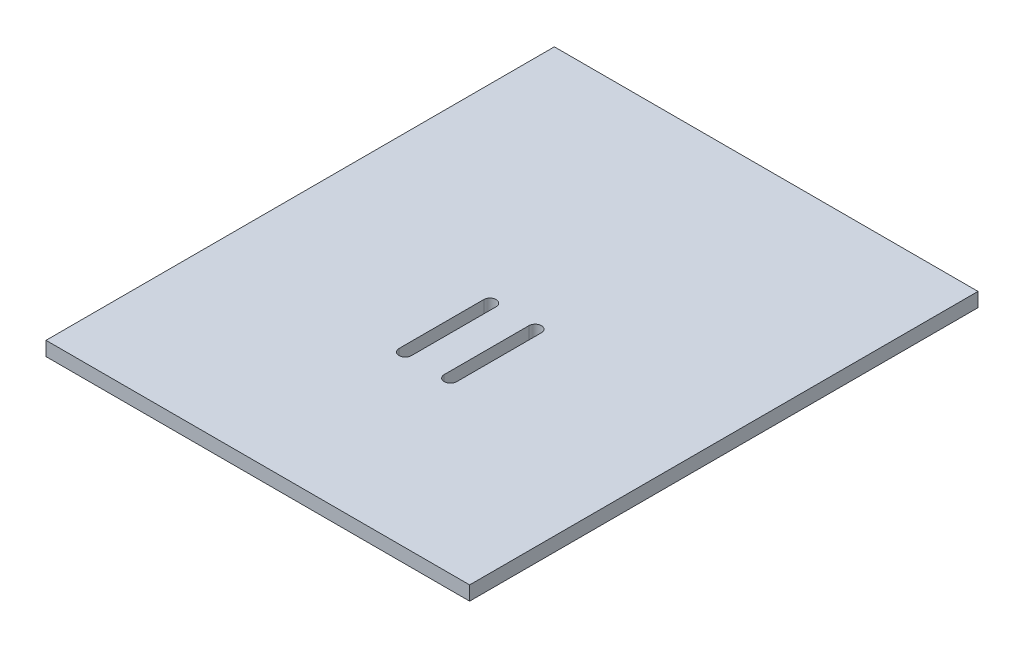
ISO-10303-21;
HEADER;
FILE_DESCRIPTION(('STEP AP214'),'2;1');
FILE_NAME('part.step','',(''),(''),'','','');
FILE_SCHEMA(('AUTOMOTIVE_DESIGN { 1 0 10303 214 1 1 1 1 }'));
ENDSEC;
DATA;
#1=APPLICATION_CONTEXT('core data for automotive mechanical design processes');
#2=APPLICATION_PROTOCOL_DEFINITION('international standard','automotive_design',2000,#1);
#3=PRODUCT_CONTEXT('',#1,'mechanical');
#4=PRODUCT('Part','Part','',(#3));
#5=PRODUCT_RELATED_PRODUCT_CATEGORY('part','',(#4));
#6=PRODUCT_DEFINITION_FORMATION('','',#4);
#7=PRODUCT_DEFINITION_CONTEXT('part definition',#1,'design');
#8=PRODUCT_DEFINITION('design','',#6,#7);
#9=PRODUCT_DEFINITION_SHAPE('','',#8);
#10=(LENGTH_UNIT() NAMED_UNIT(*) SI_UNIT(.MILLI.,.METRE.));
#11=(NAMED_UNIT(*) PLANE_ANGLE_UNIT() SI_UNIT($,.RADIAN.));
#12=(NAMED_UNIT(*) SI_UNIT($,.STERADIAN.) SOLID_ANGLE_UNIT());
#13=UNCERTAINTY_MEASURE_WITH_UNIT(LENGTH_MEASURE(1.E-05),#10,'distance_accuracy_value','');
#14=(GEOMETRIC_REPRESENTATION_CONTEXT(3) GLOBAL_UNCERTAINTY_ASSIGNED_CONTEXT((#13)) GLOBAL_UNIT_ASSIGNED_CONTEXT((#10,
#11,#12)) REPRESENTATION_CONTEXT('',''));
#15=CARTESIAN_POINT('',(0.,0.,0.));
#16=DIRECTION('',(0.,0.,1.));
#17=DIRECTION('',(1.,0.,0.));
#18=AXIS2_PLACEMENT_3D('',#15,#16,#17);
#19=CARTESIAN_POINT('',(95.25,6.35,-114.3));
#20=DIRECTION('',(-1.,0.,0.));
#21=DIRECTION('',(0.,0.,1.));
#22=AXIS2_PLACEMENT_3D('',#19,#20,#21);
#23=PLANE('',#22);
#24=DIRECTION('',(0.,0.,-1.));
#25=VECTOR('',#24,1.);
#26=CARTESIAN_POINT('',(95.25,0.,-114.3));
#27=LINE('',#26,#25);
#28=CARTESIAN_POINT('',(95.25,0.,114.3));
#29=VERTEX_POINT('',#28);
#30=CARTESIAN_POINT('',(95.25,0.,-114.3));
#31=VERTEX_POINT('',#30);
#32=EDGE_CURVE('E146',#29,#31,#27,.T.);
#33=ORIENTED_EDGE('',*,*,#32,.T.);
#34=DIRECTION('',(0.,-1.,0.));
#35=VECTOR('',#34,1.);
#36=CARTESIAN_POINT('',(95.25,6.35,-114.3));
#37=LINE('',#36,#35);
#38=CARTESIAN_POINT('',(95.25,6.35,-114.3));
#39=VERTEX_POINT('',#38);
#40=EDGE_CURVE('E11',#39,#31,#37,.T.);
#41=ORIENTED_EDGE('',*,*,#40,.F.);
#42=DIRECTION('',(0.,0.,-1.));
#43=VECTOR('',#42,1.);
#44=CARTESIAN_POINT('',(95.25,6.35,-114.3));
#45=LINE('',#44,#43);
#46=CARTESIAN_POINT('',(95.25,6.35,114.3));
#47=VERTEX_POINT('',#46);
#48=EDGE_CURVE('E220',#47,#39,#45,.T.);
#49=ORIENTED_EDGE('',*,*,#48,.F.);
#50=DIRECTION('',(0.,-1.,0.));
#51=VECTOR('',#50,1.);
#52=CARTESIAN_POINT('',(95.25,6.35,114.3));
#53=LINE('',#52,#51);
#54=EDGE_CURVE('E234',#47,#29,#53,.T.);
#55=ORIENTED_EDGE('',*,*,#54,.T.);
#56=EDGE_LOOP('',(#33,#41,#49,#55));
#57=FACE_BOUND('',#56,.T.);
#58=ADVANCED_FACE('F39',(#57),#23,.F.);
#59=CARTESIAN_POINT('',(-95.25,6.35,-114.3));
#60=DIRECTION('',(0.,0.,1.));
#61=DIRECTION('',(1.,0.,0.));
#62=AXIS2_PLACEMENT_3D('',#59,#60,#61);
#63=PLANE('',#62);
#64=DIRECTION('',(-1.,0.,0.));
#65=VECTOR('',#64,1.);
#66=CARTESIAN_POINT('',(-95.25,0.,-114.3));
#67=LINE('',#66,#65);
#68=CARTESIAN_POINT('',(-95.25,0.,-114.3));
#69=VERTEX_POINT('',#68);
#70=EDGE_CURVE('E238',#31,#69,#67,.T.);
#71=ORIENTED_EDGE('',*,*,#70,.T.);
#72=DIRECTION('',(0.,-1.,0.));
#73=VECTOR('',#72,1.);
#74=CARTESIAN_POINT('',(-95.25,6.35,-114.3));
#75=LINE('',#74,#73);
#76=CARTESIAN_POINT('',(-95.25,6.35,-114.3));
#77=VERTEX_POINT('',#76);
#78=EDGE_CURVE('E47',#77,#69,#75,.T.);
#79=ORIENTED_EDGE('',*,*,#78,.F.);
#80=DIRECTION('',(-1.,0.,0.));
#81=VECTOR('',#80,1.);
#82=CARTESIAN_POINT('',(-95.25,6.35,-114.3));
#83=LINE('',#82,#81);
#84=EDGE_CURVE('E224',#39,#77,#83,.T.);
#85=ORIENTED_EDGE('',*,*,#84,.F.);
#86=ORIENTED_EDGE('',*,*,#40,.T.);
#87=EDGE_LOOP('',(#71,#79,#85,#86));
#88=FACE_BOUND('',#87,.T.);
#89=ADVANCED_FACE('F273',(#88),#63,.F.);
#90=CARTESIAN_POINT('',(-95.25,6.35,-114.3));
#91=DIRECTION('',(1.,0.,0.));
#92=DIRECTION('',(0.,0.,-1.));
#93=AXIS2_PLACEMENT_3D('',#90,#91,#92);
#94=PLANE('',#93);
#95=DIRECTION('',(0.,0.,1.));
#96=VECTOR('',#95,1.);
#97=CARTESIAN_POINT('',(-95.25,0.,-114.3));
#98=LINE('',#97,#96);
#99=CARTESIAN_POINT('',(-95.25,0.,114.3));
#100=VERTEX_POINT('',#99);
#101=EDGE_CURVE('E241',#69,#100,#98,.T.);
#102=ORIENTED_EDGE('',*,*,#101,.T.);
#103=DIRECTION('',(0.,-1.,0.));
#104=VECTOR('',#103,1.);
#105=CARTESIAN_POINT('',(-95.25,6.35,114.3));
#106=LINE('',#105,#104);
#107=CARTESIAN_POINT('',(-95.25,6.35,114.3));
#108=VERTEX_POINT('',#107);
#109=EDGE_CURVE('E249',#108,#100,#106,.T.);
#110=ORIENTED_EDGE('',*,*,#109,.F.);
#111=DIRECTION('',(0.,0.,1.));
#112=VECTOR('',#111,1.);
#113=CARTESIAN_POINT('',(-95.25,6.35,-114.3));
#114=LINE('',#113,#112);
#115=EDGE_CURVE('E228',#77,#108,#114,.T.);
#116=ORIENTED_EDGE('',*,*,#115,.F.);
#117=ORIENTED_EDGE('',*,*,#78,.T.);
#118=EDGE_LOOP('',(#102,#110,#116,#117));
#119=FACE_BOUND('',#118,.T.);
#120=ADVANCED_FACE('F258',(#119),#94,.F.);
#121=CARTESIAN_POINT('',(-95.25,6.35,114.3));
#122=DIRECTION('',(0.,0.,-1.));
#123=DIRECTION('',(-1.,0.,0.));
#124=AXIS2_PLACEMENT_3D('',#121,#122,#123);
#125=PLANE('',#124);
#126=DIRECTION('',(1.,0.,0.));
#127=VECTOR('',#126,1.);
#128=CARTESIAN_POINT('',(-95.25,0.,114.3));
#129=LINE('',#128,#127);
#130=EDGE_CURVE('E225',#100,#29,#129,.T.);
#131=ORIENTED_EDGE('',*,*,#130,.T.);
#132=ORIENTED_EDGE('',*,*,#54,.F.);
#133=DIRECTION('',(1.,0.,0.));
#134=VECTOR('',#133,1.);
#135=CARTESIAN_POINT('',(-95.25,6.35,114.3));
#136=LINE('',#135,#134);
#137=EDGE_CURVE('E231',#108,#47,#136,.T.);
#138=ORIENTED_EDGE('',*,*,#137,.F.);
#139=ORIENTED_EDGE('',*,*,#109,.T.);
#140=EDGE_LOOP('',(#131,#132,#138,#139));
#141=FACE_BOUND('',#140,.T.);
#142=ADVANCED_FACE('F266',(#141),#125,.F.);
#143=CARTESIAN_POINT('',(0.,6.35,0.));
#144=DIRECTION('',(0.,1.,0.));
#145=DIRECTION('',(0.,0.,1.));
#146=AXIS2_PLACEMENT_3D('',#143,#144,#145);
#147=PLANE('',#146);
#148=CARTESIAN_POINT('',(-9.90600000000005,6.35,0.));
#149=DIRECTION('',(0.,1.,0.));
#150=DIRECTION('',(0.,0.,1.));
#151=AXIS2_PLACEMENT_3D('',#148,#149,#150);
#152=CIRCLE('',#151,2.79399999999999);
#153=CARTESIAN_POINT('',(-7.11200000000006,6.35,0.));
#154=VERTEX_POINT('',#153);
#155=CARTESIAN_POINT('',(-12.7,6.35,0.));
#156=VERTEX_POINT('',#155);
#157=EDGE_CURVE('E54',#154,#156,#152,.T.);
#158=ORIENTED_EDGE('',*,*,#157,.F.);
#159=DIRECTION('',(0.,0.,-1.));
#160=VECTOR('',#159,1.);
#161=CARTESIAN_POINT('',(-7.11200000000006,6.35,0.));
#162=LINE('',#161,#160);
#163=CARTESIAN_POINT('',(-7.11200000000006,6.35,38.1));
#164=VERTEX_POINT('',#163);
#165=EDGE_CURVE('E137',#164,#154,#162,.T.);
#166=ORIENTED_EDGE('',*,*,#165,.F.);
#167=CARTESIAN_POINT('',(-9.90600000000005,6.35,38.1));
#168=DIRECTION('',(0.,1.,0.));
#169=DIRECTION('',(0.,0.,1.));
#170=AXIS2_PLACEMENT_3D('',#167,#168,#169);
#171=CIRCLE('',#170,2.79399999999999);
#172=CARTESIAN_POINT('',(-12.7,6.35,38.1000000000001));
#173=VERTEX_POINT('',#172);
#174=EDGE_CURVE('E165',#173,#164,#171,.T.);
#175=ORIENTED_EDGE('',*,*,#174,.F.);
#176=DIRECTION('',(0.,0.,1.));
#177=VECTOR('',#176,1.);
#178=CARTESIAN_POINT('',(-12.7,6.35,0.));
#179=LINE('',#178,#177);
#180=EDGE_CURVE('E157',#156,#173,#179,.T.);
#181=ORIENTED_EDGE('',*,*,#180,.F.);
#182=EDGE_LOOP('',(#158,#166,#175,#181));
#183=FACE_BOUND('',#182,.T.);
#184=CARTESIAN_POINT('',(10.4139999999999,6.35,0.));
#185=DIRECTION('',(0.,1.,0.));
#186=DIRECTION('',(0.,0.,1.));
#187=AXIS2_PLACEMENT_3D('',#184,#185,#186);
#188=CIRCLE('',#187,2.794);
#189=CARTESIAN_POINT('',(13.2079999999999,6.35,0.));
#190=VERTEX_POINT('',#189);
#191=CARTESIAN_POINT('',(7.61999999999995,6.35,0.));
#192=VERTEX_POINT('',#191);
#193=EDGE_CURVE('E62',#190,#192,#188,.T.);
#194=ORIENTED_EDGE('',*,*,#193,.F.);
#195=DIRECTION('',(0.,0.,-1.));
#196=VECTOR('',#195,1.);
#197=CARTESIAN_POINT('',(13.2079999999999,6.35,0.));
#198=LINE('',#197,#196);
#199=CARTESIAN_POINT('',(13.208,6.35,38.1));
#200=VERTEX_POINT('',#199);
#201=EDGE_CURVE('E200',#200,#190,#198,.T.);
#202=ORIENTED_EDGE('',*,*,#201,.F.);
#203=CARTESIAN_POINT('',(10.414,6.35,38.1));
#204=DIRECTION('',(0.,1.,0.));
#205=DIRECTION('',(0.,0.,1.));
#206=AXIS2_PLACEMENT_3D('',#203,#204,#205);
#207=CIRCLE('',#206,2.794);
#208=CARTESIAN_POINT('',(7.61999999999995,6.35,38.1));
#209=VERTEX_POINT('',#208);
#210=EDGE_CURVE('E196',#209,#200,#207,.T.);
#211=ORIENTED_EDGE('',*,*,#210,.F.);
#212=DIRECTION('',(0.,0.,1.));
#213=VECTOR('',#212,1.);
#214=CARTESIAN_POINT('',(7.61999999999995,6.35,0.));
#215=LINE('',#214,#213);
#216=EDGE_CURVE('E192',#192,#209,#215,.T.);
#217=ORIENTED_EDGE('',*,*,#216,.F.);
#218=EDGE_LOOP('',(#194,#202,#211,#217));
#219=FACE_BOUND('',#218,.T.);
#220=ORIENTED_EDGE('',*,*,#48,.T.);
#221=ORIENTED_EDGE('',*,*,#84,.T.);
#222=ORIENTED_EDGE('',*,*,#115,.T.);
#223=ORIENTED_EDGE('',*,*,#137,.T.);
#224=EDGE_LOOP('',(#220,#221,#222,#223));
#225=FACE_BOUND('',#224,.T.);
#226=ADVANCED_FACE('F272',(#183,#219,#225),#147,.T.);
#227=CARTESIAN_POINT('',(0.,0.,0.));
#228=DIRECTION('',(0.,1.,0.));
#229=DIRECTION('',(0.,0.,1.));
#230=AXIS2_PLACEMENT_3D('',#227,#228,#229);
#231=PLANE('',#230);
#232=DIRECTION('',(0.,0.,1.));
#233=VECTOR('',#232,1.);
#234=CARTESIAN_POINT('',(-7.11200000000006,0.,0.));
#235=LINE('',#234,#233);
#236=CARTESIAN_POINT('',(-7.11200000000006,0.,0.));
#237=VERTEX_POINT('',#236);
#238=CARTESIAN_POINT('',(-7.11200000000006,0.,38.1));
#239=VERTEX_POINT('',#238);
#240=EDGE_CURVE('E152',#237,#239,#235,.T.);
#241=ORIENTED_EDGE('',*,*,#240,.F.);
#242=CARTESIAN_POINT('',(-9.90600000000005,0.,0.));
#243=DIRECTION('',(0.,1.,0.));
#244=DIRECTION('',(0.,0.,1.));
#245=AXIS2_PLACEMENT_3D('',#242,#243,#244);
#246=CIRCLE('',#245,2.79399999999999);
#247=CARTESIAN_POINT('',(-12.7,0.,0.));
#248=VERTEX_POINT('',#247);
#249=EDGE_CURVE('E130',#248,#237,#246,.F.);
#250=ORIENTED_EDGE('',*,*,#249,.F.);
#251=DIRECTION('',(0.,0.,-1.));
#252=VECTOR('',#251,1.);
#253=CARTESIAN_POINT('',(-12.7,0.,0.));
#254=LINE('',#253,#252);
#255=CARTESIAN_POINT('',(-12.7,0.,38.1000000000001));
#256=VERTEX_POINT('',#255);
#257=EDGE_CURVE('E141',#256,#248,#254,.T.);
#258=ORIENTED_EDGE('',*,*,#257,.F.);
#259=CARTESIAN_POINT('',(-9.90600000000005,0.,38.1));
#260=DIRECTION('',(0.,1.,0.));
#261=DIRECTION('',(0.,0.,1.));
#262=AXIS2_PLACEMENT_3D('',#259,#260,#261);
#263=CIRCLE('',#262,2.79399999999999);
#264=EDGE_CURVE('E159',#239,#256,#263,.F.);
#265=ORIENTED_EDGE('',*,*,#264,.F.);
#266=EDGE_LOOP('',(#241,#250,#258,#265));
#267=FACE_BOUND('',#266,.T.);
#268=DIRECTION('',(0.,0.,1.));
#269=VECTOR('',#268,1.);
#270=CARTESIAN_POINT('',(13.2079999999999,0.,0.));
#271=LINE('',#270,#269);
#272=CARTESIAN_POINT('',(13.2079999999999,0.,0.));
#273=VERTEX_POINT('',#272);
#274=CARTESIAN_POINT('',(13.208,0.,38.1));
#275=VERTEX_POINT('',#274);
#276=EDGE_CURVE('E182',#273,#275,#271,.T.);
#277=ORIENTED_EDGE('',*,*,#276,.F.);
#278=CARTESIAN_POINT('',(10.4139999999999,0.,0.));
#279=DIRECTION('',(0.,1.,0.));
#280=DIRECTION('',(0.,0.,1.));
#281=AXIS2_PLACEMENT_3D('',#278,#279,#280);
#282=CIRCLE('',#281,2.794);
#283=CARTESIAN_POINT('',(7.61999999999995,0.,0.));
#284=VERTEX_POINT('',#283);
#285=EDGE_CURVE('E186',#284,#273,#282,.F.);
#286=ORIENTED_EDGE('',*,*,#285,.F.);
#287=DIRECTION('',(0.,0.,-1.));
#288=VECTOR('',#287,1.);
#289=CARTESIAN_POINT('',(7.61999999999995,0.,0.));
#290=LINE('',#289,#288);
#291=CARTESIAN_POINT('',(7.61999999999995,0.,38.1));
#292=VERTEX_POINT('',#291);
#293=EDGE_CURVE('E208',#292,#284,#290,.T.);
#294=ORIENTED_EDGE('',*,*,#293,.F.);
#295=CARTESIAN_POINT('',(10.414,0.,38.1));
#296=DIRECTION('',(0.,1.,0.));
#297=DIRECTION('',(0.,0.,1.));
#298=AXIS2_PLACEMENT_3D('',#295,#296,#297);
#299=CIRCLE('',#298,2.794);
#300=EDGE_CURVE('E179',#275,#292,#299,.F.);
#301=ORIENTED_EDGE('',*,*,#300,.F.);
#302=EDGE_LOOP('',(#277,#286,#294,#301));
#303=FACE_BOUND('',#302,.T.);
#304=ORIENTED_EDGE('',*,*,#32,.F.);
#305=ORIENTED_EDGE('',*,*,#130,.F.);
#306=ORIENTED_EDGE('',*,*,#101,.F.);
#307=ORIENTED_EDGE('',*,*,#70,.F.);
#308=EDGE_LOOP('',(#304,#305,#306,#307));
#309=FACE_BOUND('',#308,.T.);
#310=ADVANCED_FACE('F149',(#267,#303,#309),#231,.F.);
#311=CARTESIAN_POINT('',(10.4139999999999,-0.00100000000000013,0.));
#312=DIRECTION('',(0.,1.,0.));
#313=DIRECTION('',(0.,0.,1.));
#314=AXIS2_PLACEMENT_3D('',#311,#312,#313);
#315=CYLINDRICAL_SURFACE('',#314,2.794);
#316=ORIENTED_EDGE('',*,*,#285,.T.);
#317=DIRECTION('',(0.,1.,0.));
#318=VECTOR('',#317,1.);
#319=CARTESIAN_POINT('',(13.2079999999999,-0.00100000000000013,0.));
#320=LINE('',#319,#318);
#321=EDGE_CURVE('E205',#273,#190,#320,.T.);
#322=ORIENTED_EDGE('',*,*,#321,.T.);
#323=ORIENTED_EDGE('',*,*,#193,.T.);
#324=DIRECTION('',(0.,1.,0.));
#325=VECTOR('',#324,1.);
#326=CARTESIAN_POINT('',(7.61999999999995,-0.00100000000000013,0.));
#327=LINE('',#326,#325);
#328=EDGE_CURVE('E204',#284,#192,#327,.T.);
#329=ORIENTED_EDGE('',*,*,#328,.F.);
#330=EDGE_LOOP('',(#316,#322,#323,#329));
#331=FACE_BOUND('',#330,.T.);
#332=ADVANCED_FACE('F285',(#331),#315,.F.);
#333=CARTESIAN_POINT('',(13.2079999999999,-0.00100000000000013,0.));
#334=DIRECTION('',(1.,0.,0.));
#335=DIRECTION('',(0.,0.,-1.));
#336=AXIS2_PLACEMENT_3D('',#333,#334,#335);
#337=PLANE('',#336);
#338=ORIENTED_EDGE('',*,*,#276,.T.);
#339=DIRECTION('',(0.,1.,0.));
#340=VECTOR('',#339,1.);
#341=CARTESIAN_POINT('',(13.208,-0.00100000000000013,38.1));
#342=LINE('',#341,#340);
#343=EDGE_CURVE('E209',#275,#200,#342,.T.);
#344=ORIENTED_EDGE('',*,*,#343,.T.);
#345=ORIENTED_EDGE('',*,*,#201,.T.);
#346=ORIENTED_EDGE('',*,*,#321,.F.);
#347=EDGE_LOOP('',(#338,#344,#345,#346));
#348=FACE_BOUND('',#347,.T.);
#349=ADVANCED_FACE('F291',(#348),#337,.F.);
#350=CARTESIAN_POINT('',(10.414,-0.00100000000000013,38.1));
#351=DIRECTION('',(0.,1.,0.));
#352=DIRECTION('',(0.,0.,1.));
#353=AXIS2_PLACEMENT_3D('',#350,#351,#352);
#354=CYLINDRICAL_SURFACE('',#353,2.794);
#355=ORIENTED_EDGE('',*,*,#300,.T.);
#356=DIRECTION('',(0.,1.,0.));
#357=VECTOR('',#356,1.);
#358=CARTESIAN_POINT('',(7.61999999999995,-0.00100000000000013,38.1));
#359=LINE('',#358,#357);
#360=EDGE_CURVE('E212',#292,#209,#359,.T.);
#361=ORIENTED_EDGE('',*,*,#360,.T.);
#362=ORIENTED_EDGE('',*,*,#210,.T.);
#363=ORIENTED_EDGE('',*,*,#343,.F.);
#364=EDGE_LOOP('',(#355,#361,#362,#363));
#365=FACE_BOUND('',#364,.T.);
#366=ADVANCED_FACE('F295',(#365),#354,.F.);
#367=CARTESIAN_POINT('',(7.61999999999995,-0.00100000000000013,0.));
#368=DIRECTION('',(-1.,0.,0.));
#369=DIRECTION('',(0.,0.,1.));
#370=AXIS2_PLACEMENT_3D('',#367,#368,#369);
#371=PLANE('',#370);
#372=ORIENTED_EDGE('',*,*,#293,.T.);
#373=ORIENTED_EDGE('',*,*,#328,.T.);
#374=ORIENTED_EDGE('',*,*,#216,.T.);
#375=ORIENTED_EDGE('',*,*,#360,.F.);
#376=EDGE_LOOP('',(#372,#373,#374,#375));
#377=FACE_BOUND('',#376,.T.);
#378=ADVANCED_FACE('F292',(#377),#371,.F.);
#379=CARTESIAN_POINT('',(-9.90600000000005,-0.00100000000000013,0.));
#380=DIRECTION('',(0.,1.,0.));
#381=DIRECTION('',(0.,0.,1.));
#382=AXIS2_PLACEMENT_3D('',#379,#380,#381);
#383=CYLINDRICAL_SURFACE('',#382,2.79399999999999);
#384=ORIENTED_EDGE('',*,*,#249,.T.);
#385=DIRECTION('',(0.,1.,0.));
#386=VECTOR('',#385,1.);
#387=CARTESIAN_POINT('',(-7.11200000000006,-0.00100000000000013,0.));
#388=LINE('',#387,#386);
#389=EDGE_CURVE('E147',#237,#154,#388,.T.);
#390=ORIENTED_EDGE('',*,*,#389,.T.);
#391=ORIENTED_EDGE('',*,*,#157,.T.);
#392=DIRECTION('',(0.,1.,0.));
#393=VECTOR('',#392,1.);
#394=CARTESIAN_POINT('',(-12.7,-0.00100000000000013,0.));
#395=LINE('',#394,#393);
#396=EDGE_CURVE('E126',#248,#156,#395,.T.);
#397=ORIENTED_EDGE('',*,*,#396,.F.);
#398=EDGE_LOOP('',(#384,#390,#391,#397));
#399=FACE_BOUND('',#398,.T.);
#400=ADVANCED_FACE('F128',(#399),#383,.F.);
#401=CARTESIAN_POINT('',(-7.11200000000006,-0.00100000000000013,0.));
#402=DIRECTION('',(1.,0.,0.));
#403=DIRECTION('',(0.,0.,-1.));
#404=AXIS2_PLACEMENT_3D('',#401,#402,#403);
#405=PLANE('',#404);
#406=ORIENTED_EDGE('',*,*,#240,.T.);
#407=DIRECTION('',(0.,1.,0.));
#408=VECTOR('',#407,1.);
#409=CARTESIAN_POINT('',(-7.11200000000006,-0.00100000000000013,38.1));
#410=LINE('',#409,#408);
#411=EDGE_CURVE('E174',#239,#164,#410,.T.);
#412=ORIENTED_EDGE('',*,*,#411,.T.);
#413=ORIENTED_EDGE('',*,*,#165,.T.);
#414=ORIENTED_EDGE('',*,*,#389,.F.);
#415=EDGE_LOOP('',(#406,#412,#413,#414));
#416=FACE_BOUND('',#415,.T.);
#417=ADVANCED_FACE('F305',(#416),#405,.F.);
#418=CARTESIAN_POINT('',(-9.90600000000005,-0.00100000000000013,38.1));
#419=DIRECTION('',(0.,1.,0.));
#420=DIRECTION('',(0.,0.,1.));
#421=AXIS2_PLACEMENT_3D('',#418,#419,#420);
#422=CYLINDRICAL_SURFACE('',#421,2.79399999999999);
#423=ORIENTED_EDGE('',*,*,#264,.T.);
#424=DIRECTION('',(0.,1.,0.));
#425=VECTOR('',#424,1.);
#426=CARTESIAN_POINT('',(-12.7,-0.00100000000000013,38.1000000000001));
#427=LINE('',#426,#425);
#428=EDGE_CURVE('E136',#256,#173,#427,.T.);
#429=ORIENTED_EDGE('',*,*,#428,.T.);
#430=ORIENTED_EDGE('',*,*,#174,.T.);
#431=ORIENTED_EDGE('',*,*,#411,.F.);
#432=EDGE_LOOP('',(#423,#429,#430,#431));
#433=FACE_BOUND('',#432,.T.);
#434=ADVANCED_FACE('F308',(#433),#422,.F.);
#435=CARTESIAN_POINT('',(-12.7,-0.00100000000000013,0.));
#436=DIRECTION('',(-1.,0.,0.));
#437=DIRECTION('',(0.,0.,1.));
#438=AXIS2_PLACEMENT_3D('',#435,#436,#437);
#439=PLANE('',#438);
#440=ORIENTED_EDGE('',*,*,#257,.T.);
#441=ORIENTED_EDGE('',*,*,#396,.T.);
#442=ORIENTED_EDGE('',*,*,#180,.T.);
#443=ORIENTED_EDGE('',*,*,#428,.F.);
#444=EDGE_LOOP('',(#440,#441,#442,#443));
#445=FACE_BOUND('',#444,.T.);
#446=ADVANCED_FACE('F142',(#445),#439,.F.);
#447=CLOSED_SHELL('',(#58,#89,#120,#142,#226,#310,#332,#349,#366,#378,#400,#417,#434,#446));
#448=MANIFOLD_SOLID_BREP('B2',#447);
#449=ADVANCED_BREP_SHAPE_REPRESENTATION('',(#18,#448),#14);
#450=SHAPE_DEFINITION_REPRESENTATION(#9,#449);
ENDSEC;
END-ISO-10303-21;
